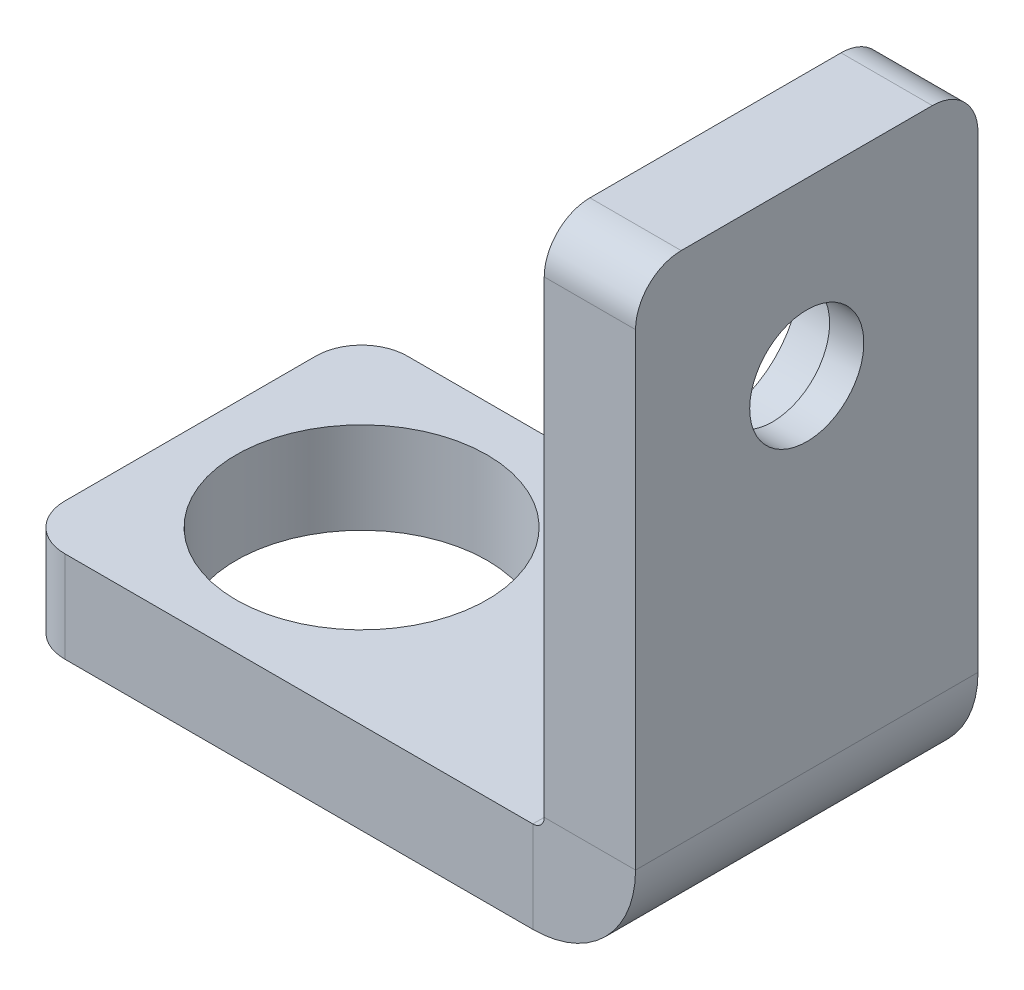
ISO-10303-21;
HEADER;
FILE_DESCRIPTION(('STEP AP214'),'2;1');
FILE_NAME('part.step','',(''),(''),'','','');
FILE_SCHEMA(('AUTOMOTIVE_DESIGN { 1 0 10303 214 1 1 1 1 }'));
ENDSEC;
DATA;
#1=APPLICATION_CONTEXT('core data for automotive mechanical design processes');
#2=APPLICATION_PROTOCOL_DEFINITION('international standard','automotive_design',2000,#1);
#3=PRODUCT_CONTEXT('',#1,'mechanical');
#4=PRODUCT('Part','Part','',(#3));
#5=PRODUCT_RELATED_PRODUCT_CATEGORY('part','',(#4));
#6=PRODUCT_DEFINITION_FORMATION('','',#4);
#7=PRODUCT_DEFINITION_CONTEXT('part definition',#1,'design');
#8=PRODUCT_DEFINITION('design','',#6,#7);
#9=PRODUCT_DEFINITION_SHAPE('','',#8);
#10=(LENGTH_UNIT() NAMED_UNIT(*) SI_UNIT(.MILLI.,.METRE.));
#11=(NAMED_UNIT(*) PLANE_ANGLE_UNIT() SI_UNIT($,.RADIAN.));
#12=(NAMED_UNIT(*) SI_UNIT($,.STERADIAN.) SOLID_ANGLE_UNIT());
#13=UNCERTAINTY_MEASURE_WITH_UNIT(LENGTH_MEASURE(1.E-05),#10,'distance_accuracy_value','');
#14=(GEOMETRIC_REPRESENTATION_CONTEXT(3) GLOBAL_UNCERTAINTY_ASSIGNED_CONTEXT((#13)) GLOBAL_UNIT_ASSIGNED_CONTEXT((#10,
#11,#12)) REPRESENTATION_CONTEXT('',''));
#15=CARTESIAN_POINT('',(0.,0.,0.));
#16=DIRECTION('',(0.,0.,1.));
#17=DIRECTION('',(1.,0.,0.));
#18=AXIS2_PLACEMENT_3D('',#15,#16,#17);
#19=CARTESIAN_POINT('',(-25.,0.,0.));
#20=DIRECTION('',(-1.,0.,0.));
#21=DIRECTION('',(0.,0.,1.));
#22=AXIS2_PLACEMENT_3D('',#19,#20,#21);
#23=PLANE('',#22);
#24=DIRECTION('',(0.,0.,1.));
#25=VECTOR('',#24,1.);
#26=CARTESIAN_POINT('',(-25.,2.,7.5));
#27=LINE('',#26,#25);
#28=CARTESIAN_POINT('',(-25.,2.,-5.5));
#29=VERTEX_POINT('',#28);
#30=CARTESIAN_POINT('',(-25.,2.,5.5));
#31=VERTEX_POINT('',#30);
#32=EDGE_CURVE('E198',#29,#31,#27,.T.);
#33=ORIENTED_EDGE('',*,*,#32,.F.);
#34=DIRECTION('',(0.,1.,0.));
#35=VECTOR('',#34,1.);
#36=CARTESIAN_POINT('',(-25.,0.,-5.5));
#37=LINE('',#36,#35);
#38=CARTESIAN_POINT('',(-25.,-2.,-5.5));
#39=VERTEX_POINT('',#38);
#40=EDGE_CURVE('E64',#29,#39,#37,.F.);
#41=ORIENTED_EDGE('',*,*,#40,.T.);
#42=DIRECTION('',(0.,0.,-1.));
#43=VECTOR('',#42,1.);
#44=CARTESIAN_POINT('',(-25.,-2.,7.5));
#45=LINE('',#44,#43);
#46=CARTESIAN_POINT('',(-25.,-2.,5.5));
#47=VERTEX_POINT('',#46);
#48=EDGE_CURVE('E147',#47,#39,#45,.T.);
#49=ORIENTED_EDGE('',*,*,#48,.F.);
#50=DIRECTION('',(0.,-1.,0.));
#51=VECTOR('',#50,1.);
#52=CARTESIAN_POINT('',(-25.,0.,5.5));
#53=LINE('',#52,#51);
#54=EDGE_CURVE('E282',#47,#31,#53,.F.);
#55=ORIENTED_EDGE('',*,*,#54,.T.);
#56=EDGE_LOOP('',(#33,#41,#49,#55));
#57=FACE_BOUND('',#56,.T.);
#58=ADVANCED_FACE('F40',(#57),#23,.T.);
#59=CARTESIAN_POINT('',(0.,25.,0.));
#60=DIRECTION('',(0.,-1.,0.));
#61=DIRECTION('',(0.,0.,1.));
#62=AXIS2_PLACEMENT_3D('',#59,#60,#61);
#63=PLANE('',#62);
#64=DIRECTION('',(0.,0.,-1.));
#65=VECTOR('',#64,1.);
#66=CARTESIAN_POINT('',(2.,25.,7.5));
#67=LINE('',#66,#65);
#68=CARTESIAN_POINT('',(2.,25.,5.5));
#69=VERTEX_POINT('',#68);
#70=CARTESIAN_POINT('',(2.,25.,-5.5));
#71=VERTEX_POINT('',#70);
#72=EDGE_CURVE('E238',#69,#71,#67,.T.);
#73=ORIENTED_EDGE('',*,*,#72,.T.);
#74=DIRECTION('',(-1.,0.,0.));
#75=VECTOR('',#74,1.);
#76=CARTESIAN_POINT('',(-2.,25.,-5.5));
#77=LINE('',#76,#75);
#78=CARTESIAN_POINT('',(-2.,25.,-5.5));
#79=VERTEX_POINT('',#78);
#80=EDGE_CURVE('E251',#71,#79,#77,.T.);
#81=ORIENTED_EDGE('',*,*,#80,.T.);
#82=DIRECTION('',(0.,0.,1.));
#83=VECTOR('',#82,1.);
#84=CARTESIAN_POINT('',(-2.,25.,7.5));
#85=LINE('',#84,#83);
#86=CARTESIAN_POINT('',(-2.,25.,5.5));
#87=VERTEX_POINT('',#86);
#88=EDGE_CURVE('E192',#79,#87,#85,.T.);
#89=ORIENTED_EDGE('',*,*,#88,.T.);
#90=DIRECTION('',(1.,0.,0.));
#91=VECTOR('',#90,1.);
#92=CARTESIAN_POINT('',(2.,25.,5.5));
#93=LINE('',#92,#91);
#94=EDGE_CURVE('E247',#87,#69,#93,.T.);
#95=ORIENTED_EDGE('',*,*,#94,.T.);
#96=EDGE_LOOP('',(#73,#81,#89,#95));
#97=FACE_BOUND('',#96,.T.);
#98=ADVANCED_FACE('F336',(#97),#63,.F.);
#99=CARTESIAN_POINT('',(-25.,-2.,-7.5));
#100=DIRECTION('',(0.,0.,-1.));
#101=DIRECTION('',(-1.,0.,0.));
#102=AXIS2_PLACEMENT_3D('',#99,#100,#101);
#103=PLANE('',#102);
#104=DIRECTION('',(1.,0.,0.));
#105=VECTOR('',#104,1.);
#106=CARTESIAN_POINT('',(-25.,-2.,-7.5));
#107=LINE('',#106,#105);
#108=CARTESIAN_POINT('',(-23.,-2.,-7.5));
#109=VERTEX_POINT('',#108);
#110=CARTESIAN_POINT('',(-2.50000000000002,-2.,-7.5));
#111=VERTEX_POINT('',#110);
#112=EDGE_CURVE('E133',#109,#111,#107,.T.);
#113=ORIENTED_EDGE('',*,*,#112,.F.);
#114=DIRECTION('',(0.,1.,0.));
#115=VECTOR('',#114,1.);
#116=CARTESIAN_POINT('',(-23.,-2.,-7.5));
#117=LINE('',#116,#115);
#118=CARTESIAN_POINT('',(-23.,2.,-7.5));
#119=VERTEX_POINT('',#118);
#120=EDGE_CURVE('E273',#109,#119,#117,.T.);
#121=ORIENTED_EDGE('',*,*,#120,.T.);
#122=DIRECTION('',(1.,0.,0.));
#123=VECTOR('',#122,1.);
#124=CARTESIAN_POINT('',(-25.,2.,-7.5));
#125=LINE('',#124,#123);
#126=CARTESIAN_POINT('',(-2.50000000000002,2.,-7.5));
#127=VERTEX_POINT('',#126);
#128=EDGE_CURVE('E171',#119,#127,#125,.T.);
#129=ORIENTED_EDGE('',*,*,#128,.T.);
#130=DIRECTION('',(0.,1.,0.));
#131=VECTOR('',#130,1.);
#132=CARTESIAN_POINT('',(-2.50000000000002,-2.,-7.5));
#133=LINE('',#132,#131);
#134=EDGE_CURVE('E146',#111,#127,#133,.T.);
#135=ORIENTED_EDGE('',*,*,#134,.F.);
#136=EDGE_LOOP('',(#113,#121,#129,#135));
#137=FACE_BOUND('',#136,.T.);
#138=ADVANCED_FACE('F169',(#137),#103,.T.);
#139=CARTESIAN_POINT('',(-25.,2.,7.5));
#140=DIRECTION('',(0.,1.,0.));
#141=DIRECTION('',(0.,0.,1.));
#142=AXIS2_PLACEMENT_3D('',#139,#140,#141);
#143=PLANE('',#142);
#144=CARTESIAN_POINT('',(-17.5,2.,0.));
#145=DIRECTION('',(0.,1.,0.));
#146=DIRECTION('',(0.,0.,1.));
#147=AXIS2_PLACEMENT_3D('',#144,#145,#146);
#148=CIRCLE('',#147,5.5);
#149=CARTESIAN_POINT('',(-17.5,2.,5.5));
#150=VERTEX_POINT('',#149);
#151=EDGE_CURVE('E179',#150,#150,#148,.T.);
#152=ORIENTED_EDGE('',*,*,#151,.F.);
#153=EDGE_LOOP('',(#152));
#154=FACE_BOUND('',#153,.T.);
#155=ORIENTED_EDGE('',*,*,#128,.F.);
#156=CARTESIAN_POINT('',(-23.,2.,-5.5));
#157=DIRECTION('',(0.,1.,0.));
#158=DIRECTION('',(0.,0.,1.));
#159=AXIS2_PLACEMENT_3D('',#156,#157,#158);
#160=CIRCLE('',#159,2.);
#161=EDGE_CURVE('E279',#119,#29,#160,.T.);
#162=ORIENTED_EDGE('',*,*,#161,.T.);
#163=ORIENTED_EDGE('',*,*,#32,.T.);
#164=CARTESIAN_POINT('',(-23.,2.,5.5));
#165=DIRECTION('',(0.,1.,0.));
#166=DIRECTION('',(0.,0.,1.));
#167=AXIS2_PLACEMENT_3D('',#164,#165,#166);
#168=CIRCLE('',#167,2.);
#169=CARTESIAN_POINT('',(-23.,2.,7.5));
#170=VERTEX_POINT('',#169);
#171=EDGE_CURVE('E276',#31,#170,#168,.T.);
#172=ORIENTED_EDGE('',*,*,#171,.T.);
#173=DIRECTION('',(1.,0.,0.));
#174=VECTOR('',#173,1.);
#175=CARTESIAN_POINT('',(-25.,2.,7.5));
#176=LINE('',#175,#174);
#177=CARTESIAN_POINT('',(-2.50000000000002,2.,7.5));
#178=VERTEX_POINT('',#177);
#179=EDGE_CURVE('E206',#170,#178,#176,.T.);
#180=ORIENTED_EDGE('',*,*,#179,.T.);
#181=DIRECTION('',(0.,0.,1.));
#182=VECTOR('',#181,1.);
#183=CARTESIAN_POINT('',(-2.50000000000002,2.,7.5));
#184=LINE('',#183,#182);
#185=EDGE_CURVE('E176',#127,#178,#184,.T.);
#186=ORIENTED_EDGE('',*,*,#185,.F.);
#187=EDGE_LOOP('',(#155,#162,#163,#172,#180,#186));
#188=FACE_BOUND('',#187,.T.);
#189=ADVANCED_FACE('F293',(#154,#188),#143,.T.);
#190=CARTESIAN_POINT('',(-25.,-2.,7.5));
#191=DIRECTION('',(0.,0.,1.));
#192=DIRECTION('',(1.,0.,0.));
#193=AXIS2_PLACEMENT_3D('',#190,#191,#192);
#194=PLANE('',#193);
#195=ORIENTED_EDGE('',*,*,#179,.F.);
#196=DIRECTION('',(0.,-1.,0.));
#197=VECTOR('',#196,1.);
#198=CARTESIAN_POINT('',(-23.,-2.,7.5));
#199=LINE('',#198,#197);
#200=CARTESIAN_POINT('',(-23.,-2.,7.5));
#201=VERTEX_POINT('',#200);
#202=EDGE_CURVE('E12',#170,#201,#199,.T.);
#203=ORIENTED_EDGE('',*,*,#202,.T.);
#204=DIRECTION('',(1.,0.,0.));
#205=VECTOR('',#204,1.);
#206=CARTESIAN_POINT('',(-25.,-2.,7.5));
#207=LINE('',#206,#205);
#208=CARTESIAN_POINT('',(-2.50000000000002,-2.,7.5));
#209=VERTEX_POINT('',#208);
#210=EDGE_CURVE('E167',#201,#209,#207,.T.);
#211=ORIENTED_EDGE('',*,*,#210,.T.);
#212=DIRECTION('',(0.,-1.,0.));
#213=VECTOR('',#212,1.);
#214=CARTESIAN_POINT('',(-2.50000000000002,-2.,7.5));
#215=LINE('',#214,#213);
#216=EDGE_CURVE('E209',#178,#209,#215,.T.);
#217=ORIENTED_EDGE('',*,*,#216,.F.);
#218=EDGE_LOOP('',(#195,#203,#211,#217));
#219=FACE_BOUND('',#218,.T.);
#220=ADVANCED_FACE('F298',(#219),#194,.T.);
#221=CARTESIAN_POINT('',(-25.,-2.,7.5));
#222=DIRECTION('',(0.,-1.,0.));
#223=DIRECTION('',(0.,0.,-1.));
#224=AXIS2_PLACEMENT_3D('',#221,#222,#223);
#225=PLANE('',#224);
#226=CARTESIAN_POINT('',(-17.5,-2.00000000000018,0.));
#227=DIRECTION('',(0.,1.,0.));
#228=DIRECTION('',(0.,0.,1.));
#229=AXIS2_PLACEMENT_3D('',#226,#227,#228);
#230=CIRCLE('',#229,5.5);
#231=CARTESIAN_POINT('',(-17.5,-2.00000000000018,5.5));
#232=VERTEX_POINT('',#231);
#233=EDGE_CURVE('E202',#232,#232,#230,.T.);
#234=ORIENTED_EDGE('',*,*,#233,.T.);
#235=EDGE_LOOP('',(#234));
#236=FACE_BOUND('',#235,.T.);
#237=ORIENTED_EDGE('',*,*,#48,.T.);
#238=CARTESIAN_POINT('',(-23.,-2.,-5.5));
#239=DIRECTION('',(0.,-1.,0.));
#240=DIRECTION('',(0.,0.,-1.));
#241=AXIS2_PLACEMENT_3D('',#238,#239,#240);
#242=CIRCLE('',#241,2.);
#243=EDGE_CURVE('E50',#39,#109,#242,.T.);
#244=ORIENTED_EDGE('',*,*,#243,.T.);
#245=ORIENTED_EDGE('',*,*,#112,.T.);
#246=DIRECTION('',(0.,0.,-1.));
#247=VECTOR('',#246,1.);
#248=CARTESIAN_POINT('',(-2.50000000000002,-2.,7.5));
#249=LINE('',#248,#247);
#250=EDGE_CURVE('E138',#209,#111,#249,.T.);
#251=ORIENTED_EDGE('',*,*,#250,.F.);
#252=ORIENTED_EDGE('',*,*,#210,.F.);
#253=CARTESIAN_POINT('',(-23.,-2.,5.5));
#254=DIRECTION('',(0.,-1.,0.));
#255=DIRECTION('',(0.,0.,-1.));
#256=AXIS2_PLACEMENT_3D('',#253,#254,#255);
#257=CIRCLE('',#256,2.);
#258=EDGE_CURVE('E57',#201,#47,#257,.T.);
#259=ORIENTED_EDGE('',*,*,#258,.T.);
#260=EDGE_LOOP('',(#237,#244,#245,#251,#252,#259));
#261=FACE_BOUND('',#260,.T.);
#262=ADVANCED_FACE('F135',(#236,#261),#225,.T.);
#263=CARTESIAN_POINT('',(-2.50000000000002,-2.00000000000018,-7.5));
#264=DIRECTION('',(0.,0.,-1.));
#265=DIRECTION('',(-1.,0.,0.));
#266=AXIS2_PLACEMENT_3D('',#263,#264,#265);
#267=PLANE('',#266);
#268=CARTESIAN_POINT('',(-2.5,2.5,-7.5));
#269=DIRECTION('',(0.,0.,1.));
#270=DIRECTION('',(0.,-1.,0.));
#271=AXIS2_PLACEMENT_3D('',#268,#269,#270);
#272=CIRCLE('',#271,0.500000000000182);
#273=CARTESIAN_POINT('',(-1.99999999999982,2.5,-7.5));
#274=VERTEX_POINT('',#273);
#275=EDGE_CURVE('E184',#127,#274,#272,.T.);
#276=ORIENTED_EDGE('',*,*,#275,.T.);
#277=DIRECTION('',(-1.,0.,0.));
#278=VECTOR('',#277,1.);
#279=CARTESIAN_POINT('',(2.,2.5,-7.5));
#280=LINE('',#279,#278);
#281=CARTESIAN_POINT('',(2.00000000000018,2.5,-7.5));
#282=VERTEX_POINT('',#281);
#283=EDGE_CURVE('E157',#282,#274,#280,.T.);
#284=ORIENTED_EDGE('',*,*,#283,.F.);
#285=CARTESIAN_POINT('',(-2.5,2.5,-7.5));
#286=DIRECTION('',(0.,0.,1.));
#287=DIRECTION('',(0.,-1.,0.));
#288=AXIS2_PLACEMENT_3D('',#285,#286,#287);
#289=CIRCLE('',#288,4.50000000000018);
#290=EDGE_CURVE('E153',#111,#282,#289,.T.);
#291=ORIENTED_EDGE('',*,*,#290,.F.);
#292=ORIENTED_EDGE('',*,*,#134,.T.);
#293=EDGE_LOOP('',(#276,#284,#291,#292));
#294=FACE_BOUND('',#293,.T.);
#295=ADVANCED_FACE('F155',(#294),#267,.T.);
#296=CARTESIAN_POINT('',(-2.5,2.5,0.));
#297=DIRECTION('',(0.,0.,1.));
#298=DIRECTION('',(1.,0.,0.));
#299=AXIS2_PLACEMENT_3D('',#296,#297,#298);
#300=CYLINDRICAL_SURFACE('',#299,0.500000000000182);
#301=CARTESIAN_POINT('',(-2.5,2.5,7.5));
#302=DIRECTION('',(0.,0.,1.));
#303=DIRECTION('',(0.,-1.,0.));
#304=AXIS2_PLACEMENT_3D('',#301,#302,#303);
#305=CIRCLE('',#304,0.500000000000182);
#306=CARTESIAN_POINT('',(-1.99999999999982,2.5,7.5));
#307=VERTEX_POINT('',#306);
#308=EDGE_CURVE('E213',#178,#307,#305,.T.);
#309=ORIENTED_EDGE('',*,*,#308,.T.);
#310=DIRECTION('',(0.,0.,1.));
#311=VECTOR('',#310,1.);
#312=CARTESIAN_POINT('',(-2.,2.5,7.5));
#313=LINE('',#312,#311);
#314=EDGE_CURVE('E186',#274,#307,#313,.T.);
#315=ORIENTED_EDGE('',*,*,#314,.F.);
#316=ORIENTED_EDGE('',*,*,#275,.F.);
#317=ORIENTED_EDGE('',*,*,#185,.T.);
#318=EDGE_LOOP('',(#309,#315,#316,#317));
#319=FACE_BOUND('',#318,.T.);
#320=ADVANCED_FACE('F301',(#319),#300,.F.);
#321=CARTESIAN_POINT('',(-2.50000000000002,-2.00000000000018,7.5));
#322=DIRECTION('',(0.,0.,1.));
#323=DIRECTION('',(1.,0.,0.));
#324=AXIS2_PLACEMENT_3D('',#321,#322,#323);
#325=PLANE('',#324);
#326=CARTESIAN_POINT('',(-2.5,2.5,7.5));
#327=DIRECTION('',(0.,0.,1.));
#328=DIRECTION('',(0.,-1.,0.));
#329=AXIS2_PLACEMENT_3D('',#326,#327,#328);
#330=CIRCLE('',#329,4.50000000000018);
#331=CARTESIAN_POINT('',(2.00000000000018,2.5,7.5));
#332=VERTEX_POINT('',#331);
#333=EDGE_CURVE('E165',#209,#332,#330,.T.);
#334=ORIENTED_EDGE('',*,*,#333,.T.);
#335=DIRECTION('',(1.,0.,0.));
#336=VECTOR('',#335,1.);
#337=CARTESIAN_POINT('',(2.,2.5,7.5));
#338=LINE('',#337,#336);
#339=EDGE_CURVE('E217',#307,#332,#338,.T.);
#340=ORIENTED_EDGE('',*,*,#339,.F.);
#341=ORIENTED_EDGE('',*,*,#308,.F.);
#342=ORIENTED_EDGE('',*,*,#216,.T.);
#343=EDGE_LOOP('',(#334,#340,#341,#342));
#344=FACE_BOUND('',#343,.T.);
#345=ADVANCED_FACE('F359',(#344),#325,.T.);
#346=CARTESIAN_POINT('',(-2.5,2.5,0.));
#347=DIRECTION('',(0.,0.,1.));
#348=DIRECTION('',(1.,0.,0.));
#349=AXIS2_PLACEMENT_3D('',#346,#347,#348);
#350=CYLINDRICAL_SURFACE('',#349,4.50000000000018);
#351=DIRECTION('',(0.,0.,-1.));
#352=VECTOR('',#351,1.);
#353=CARTESIAN_POINT('',(2.,2.5,7.5));
#354=LINE('',#353,#352);
#355=EDGE_CURVE('E197',#332,#282,#354,.T.);
#356=ORIENTED_EDGE('',*,*,#355,.F.);
#357=ORIENTED_EDGE('',*,*,#333,.F.);
#358=ORIENTED_EDGE('',*,*,#250,.T.);
#359=ORIENTED_EDGE('',*,*,#290,.T.);
#360=EDGE_LOOP('',(#356,#357,#358,#359));
#361=FACE_BOUND('',#360,.T.);
#362=ADVANCED_FACE('F163',(#361),#350,.T.);
#363=CARTESIAN_POINT('',(2.,2.5,-7.5));
#364=DIRECTION('',(0.,0.,-1.));
#365=DIRECTION('',(-1.,0.,0.));
#366=AXIS2_PLACEMENT_3D('',#363,#364,#365);
#367=PLANE('',#366);
#368=DIRECTION('',(0.,1.,0.));
#369=VECTOR('',#368,1.);
#370=CARTESIAN_POINT('',(-2.,2.5,-7.5));
#371=LINE('',#370,#369);
#372=CARTESIAN_POINT('',(-2.,23.,-7.5));
#373=VERTEX_POINT('',#372);
#374=EDGE_CURVE('E188',#274,#373,#371,.T.);
#375=ORIENTED_EDGE('',*,*,#374,.T.);
#376=DIRECTION('',(-1.,0.,0.));
#377=VECTOR('',#376,1.);
#378=CARTESIAN_POINT('',(2.,23.,-7.5));
#379=LINE('',#378,#377);
#380=CARTESIAN_POINT('',(2.,23.,-7.5));
#381=VERTEX_POINT('',#380);
#382=EDGE_CURVE('E261',#373,#381,#379,.F.);
#383=ORIENTED_EDGE('',*,*,#382,.T.);
#384=DIRECTION('',(0.,1.,0.));
#385=VECTOR('',#384,1.);
#386=CARTESIAN_POINT('',(2.,2.5,-7.5));
#387=LINE('',#386,#385);
#388=EDGE_CURVE('E193',#282,#381,#387,.T.);
#389=ORIENTED_EDGE('',*,*,#388,.F.);
#390=ORIENTED_EDGE('',*,*,#283,.T.);
#391=EDGE_LOOP('',(#375,#383,#389,#390));
#392=FACE_BOUND('',#391,.T.);
#393=ADVANCED_FACE('F366',(#392),#367,.T.);
#394=CARTESIAN_POINT('',(-2.,2.5,7.5));
#395=DIRECTION('',(-1.,0.,0.));
#396=DIRECTION('',(0.,0.,1.));
#397=AXIS2_PLACEMENT_3D('',#394,#395,#396);
#398=PLANE('',#397);
#399=CARTESIAN_POINT('',(-2.,17.5,0.));
#400=DIRECTION('',(-1.,0.,0.));
#401=DIRECTION('',(0.,0.,1.));
#402=AXIS2_PLACEMENT_3D('',#399,#400,#401);
#403=CIRCLE('',#402,3.7);
#404=CARTESIAN_POINT('',(-2.,17.5,3.7));
#405=VERTEX_POINT('',#404);
#406=EDGE_CURVE('E390',#405,#405,#403,.T.);
#407=ORIENTED_EDGE('',*,*,#406,.F.);
#408=EDGE_LOOP('',(#407));
#409=FACE_BOUND('',#408,.T.);
#410=ORIENTED_EDGE('',*,*,#88,.F.);
#411=CARTESIAN_POINT('',(-2.,23.,-5.5));
#412=DIRECTION('',(-1.,0.,0.));
#413=DIRECTION('',(0.,0.,1.));
#414=AXIS2_PLACEMENT_3D('',#411,#412,#413);
#415=CIRCLE('',#414,2.);
#416=EDGE_CURVE('E258',#79,#373,#415,.T.);
#417=ORIENTED_EDGE('',*,*,#416,.T.);
#418=ORIENTED_EDGE('',*,*,#374,.F.);
#419=ORIENTED_EDGE('',*,*,#314,.T.);
#420=DIRECTION('',(0.,1.,0.));
#421=VECTOR('',#420,1.);
#422=CARTESIAN_POINT('',(-2.,2.5,7.5));
#423=LINE('',#422,#421);
#424=CARTESIAN_POINT('',(-2.,23.,7.5));
#425=VERTEX_POINT('',#424);
#426=EDGE_CURVE('E221',#307,#425,#423,.T.);
#427=ORIENTED_EDGE('',*,*,#426,.T.);
#428=CARTESIAN_POINT('',(-2.,23.,5.5));
#429=DIRECTION('',(-1.,0.,0.));
#430=DIRECTION('',(0.,0.,1.));
#431=AXIS2_PLACEMENT_3D('',#428,#429,#430);
#432=CIRCLE('',#431,2.);
#433=EDGE_CURVE('E255',#425,#87,#432,.T.);
#434=ORIENTED_EDGE('',*,*,#433,.T.);
#435=EDGE_LOOP('',(#410,#417,#418,#419,#427,#434));
#436=FACE_BOUND('',#435,.T.);
#437=ADVANCED_FACE('F328',(#409,#436),#398,.T.);
#438=CARTESIAN_POINT('',(2.,2.5,7.5));
#439=DIRECTION('',(0.,0.,1.));
#440=DIRECTION('',(1.,0.,0.));
#441=AXIS2_PLACEMENT_3D('',#438,#439,#440);
#442=PLANE('',#441);
#443=DIRECTION('',(0.,1.,0.));
#444=VECTOR('',#443,1.);
#445=CARTESIAN_POINT('',(2.,2.5,7.5));
#446=LINE('',#445,#444);
#447=CARTESIAN_POINT('',(2.,23.,7.5));
#448=VERTEX_POINT('',#447);
#449=EDGE_CURVE('E225',#332,#448,#446,.T.);
#450=ORIENTED_EDGE('',*,*,#449,.T.);
#451=DIRECTION('',(1.,0.,0.));
#452=VECTOR('',#451,1.);
#453=CARTESIAN_POINT('',(-2.,23.,7.5));
#454=LINE('',#453,#452);
#455=EDGE_CURVE('E270',#448,#425,#454,.F.);
#456=ORIENTED_EDGE('',*,*,#455,.T.);
#457=ORIENTED_EDGE('',*,*,#426,.F.);
#458=ORIENTED_EDGE('',*,*,#339,.T.);
#459=EDGE_LOOP('',(#450,#456,#457,#458));
#460=FACE_BOUND('',#459,.T.);
#461=ADVANCED_FACE('F318',(#460),#442,.T.);
#462=CARTESIAN_POINT('',(2.,2.5,7.5));
#463=DIRECTION('',(1.,0.,0.));
#464=DIRECTION('',(0.,0.,-1.));
#465=AXIS2_PLACEMENT_3D('',#462,#463,#464);
#466=PLANE('',#465);
#467=CARTESIAN_POINT('',(2.00000000000018,17.5,0.));
#468=DIRECTION('',(-1.,0.,0.));
#469=DIRECTION('',(0.,0.,1.));
#470=AXIS2_PLACEMENT_3D('',#467,#468,#469);
#471=CIRCLE('',#470,2.5);
#472=CARTESIAN_POINT('',(2.00000000000018,17.5,2.5));
#473=VERTEX_POINT('',#472);
#474=EDGE_CURVE('E382',#473,#473,#471,.T.);
#475=ORIENTED_EDGE('',*,*,#474,.T.);
#476=EDGE_LOOP('',(#475));
#477=FACE_BOUND('',#476,.T.);
#478=ORIENTED_EDGE('',*,*,#388,.T.);
#479=CARTESIAN_POINT('',(2.,23.,-5.5));
#480=DIRECTION('',(1.,0.,0.));
#481=DIRECTION('',(0.,0.,-1.));
#482=AXIS2_PLACEMENT_3D('',#479,#480,#481);
#483=CIRCLE('',#482,2.);
#484=EDGE_CURVE('E267',#381,#71,#483,.T.);
#485=ORIENTED_EDGE('',*,*,#484,.T.);
#486=ORIENTED_EDGE('',*,*,#72,.F.);
#487=CARTESIAN_POINT('',(2.,23.,5.5));
#488=DIRECTION('',(1.,0.,0.));
#489=DIRECTION('',(0.,0.,-1.));
#490=AXIS2_PLACEMENT_3D('',#487,#488,#489);
#491=CIRCLE('',#490,2.);
#492=EDGE_CURVE('E264',#69,#448,#491,.T.);
#493=ORIENTED_EDGE('',*,*,#492,.T.);
#494=ORIENTED_EDGE('',*,*,#449,.F.);
#495=ORIENTED_EDGE('',*,*,#355,.T.);
#496=EDGE_LOOP('',(#478,#485,#486,#493,#494,#495));
#497=FACE_BOUND('',#496,.T.);
#498=ADVANCED_FACE('F315',(#477,#497),#466,.T.);
#499=CARTESIAN_POINT('',(-17.5,-2.00000000000018,0.));
#500=DIRECTION('',(0.,1.,0.));
#501=DIRECTION('',(0.,0.,1.));
#502=AXIS2_PLACEMENT_3D('',#499,#500,#501);
#503=CYLINDRICAL_SURFACE('',#502,5.5);
#504=ORIENTED_EDGE('',*,*,#233,.F.);
#505=EDGE_LOOP('',(#504));
#506=FACE_BOUND('',#505,.T.);
#507=ORIENTED_EDGE('',*,*,#151,.T.);
#508=EDGE_LOOP('',(#507));
#509=FACE_BOUND('',#508,.T.);
#510=ADVANCED_FACE('F317',(#506,#509),#503,.F.);
#511=CARTESIAN_POINT('',(2.00000000000018,17.5,0.));
#512=DIRECTION('',(-1.,0.,0.));
#513=DIRECTION('',(0.,0.,1.));
#514=AXIS2_PLACEMENT_3D('',#511,#512,#513);
#515=CYLINDRICAL_SURFACE('',#514,2.5);
#516=CARTESIAN_POINT('',(0.5,17.5,0.));
#517=DIRECTION('',(1.,0.,0.));
#518=DIRECTION('',(0.,0.,-1.));
#519=AXIS2_PLACEMENT_3D('',#516,#517,#518);
#520=CIRCLE('',#519,2.5);
#521=CARTESIAN_POINT('',(0.5,17.5,-2.5));
#522=VERTEX_POINT('',#521);
#523=EDGE_CURVE('E44',#522,#522,#520,.F.);
#524=ORIENTED_EDGE('',*,*,#523,.T.);
#525=EDGE_LOOP('',(#524));
#526=FACE_BOUND('',#525,.T.);
#527=ORIENTED_EDGE('',*,*,#474,.F.);
#528=EDGE_LOOP('',(#527));
#529=FACE_BOUND('',#528,.T.);
#530=ADVANCED_FACE('F325',(#526,#529),#515,.F.);
#531=CARTESIAN_POINT('',(0.,23.,-5.5));
#532=DIRECTION('',(1.,0.,0.));
#533=DIRECTION('',(0.,0.,-1.));
#534=AXIS2_PLACEMENT_3D('',#531,#532,#533);
#535=CYLINDRICAL_SURFACE('',#534,2.);
#536=ORIENTED_EDGE('',*,*,#484,.F.);
#537=ORIENTED_EDGE('',*,*,#382,.F.);
#538=ORIENTED_EDGE('',*,*,#416,.F.);
#539=ORIENTED_EDGE('',*,*,#80,.F.);
#540=EDGE_LOOP('',(#536,#537,#538,#539));
#541=FACE_BOUND('',#540,.T.);
#542=ADVANCED_FACE('F312',(#541),#535,.T.);
#543=CARTESIAN_POINT('',(0.,23.,5.5));
#544=DIRECTION('',(-1.,0.,0.));
#545=DIRECTION('',(0.,0.,1.));
#546=AXIS2_PLACEMENT_3D('',#543,#544,#545);
#547=CYLINDRICAL_SURFACE('',#546,2.);
#548=ORIENTED_EDGE('',*,*,#433,.F.);
#549=ORIENTED_EDGE('',*,*,#455,.F.);
#550=ORIENTED_EDGE('',*,*,#492,.F.);
#551=ORIENTED_EDGE('',*,*,#94,.F.);
#552=EDGE_LOOP('',(#548,#549,#550,#551));
#553=FACE_BOUND('',#552,.T.);
#554=ADVANCED_FACE('F306',(#553),#547,.T.);
#555=CARTESIAN_POINT('',(-23.,-2.,-5.5));
#556=DIRECTION('',(0.,1.,0.));
#557=DIRECTION('',(0.,0.,1.));
#558=AXIS2_PLACEMENT_3D('',#555,#556,#557);
#559=CYLINDRICAL_SURFACE('',#558,2.);
#560=ORIENTED_EDGE('',*,*,#243,.F.);
#561=ORIENTED_EDGE('',*,*,#40,.F.);
#562=ORIENTED_EDGE('',*,*,#161,.F.);
#563=ORIENTED_EDGE('',*,*,#120,.F.);
#564=EDGE_LOOP('',(#560,#561,#562,#563));
#565=FACE_BOUND('',#564,.T.);
#566=ADVANCED_FACE('F304',(#565),#559,.T.);
#567=CARTESIAN_POINT('',(-23.,-2.,5.5));
#568=DIRECTION('',(0.,-1.,0.));
#569=DIRECTION('',(0.,0.,-1.));
#570=AXIS2_PLACEMENT_3D('',#567,#568,#569);
#571=CYLINDRICAL_SURFACE('',#570,2.);
#572=ORIENTED_EDGE('',*,*,#171,.F.);
#573=ORIENTED_EDGE('',*,*,#54,.F.);
#574=ORIENTED_EDGE('',*,*,#258,.F.);
#575=ORIENTED_EDGE('',*,*,#202,.F.);
#576=EDGE_LOOP('',(#572,#573,#574,#575));
#577=FACE_BOUND('',#576,.T.);
#578=ADVANCED_FACE('F42',(#577),#571,.T.);
#579=CARTESIAN_POINT('',(0.5,2.5,7.5));
#580=DIRECTION('',(1.,0.,0.));
#581=DIRECTION('',(0.,0.,-1.));
#582=AXIS2_PLACEMENT_3D('',#579,#580,#581);
#583=PLANE('',#582);
#584=CARTESIAN_POINT('',(0.5,17.5,0.));
#585=DIRECTION('',(1.,0.,0.));
#586=DIRECTION('',(0.,0.,-1.));
#587=AXIS2_PLACEMENT_3D('',#584,#585,#586);
#588=CIRCLE('',#587,3.7);
#589=CARTESIAN_POINT('',(0.5,17.5,-3.7));
#590=VERTEX_POINT('',#589);
#591=EDGE_CURVE('E386',#590,#590,#588,.F.);
#592=ORIENTED_EDGE('',*,*,#591,.T.);
#593=EDGE_LOOP('',(#592));
#594=FACE_BOUND('',#593,.T.);
#595=ORIENTED_EDGE('',*,*,#523,.F.);
#596=EDGE_LOOP('',(#595));
#597=FACE_BOUND('',#596,.T.);
#598=ADVANCED_FACE('F311',(#594,#597),#583,.F.);
#599=CARTESIAN_POINT('',(12.4651803615609,17.5,0.));
#600=DIRECTION('',(-1.,0.,0.));
#601=DIRECTION('',(0.,0.,1.));
#602=AXIS2_PLACEMENT_3D('',#599,#600,#601);
#603=CYLINDRICAL_SURFACE('',#602,3.7);
#604=ORIENTED_EDGE('',*,*,#406,.T.);
#605=EDGE_LOOP('',(#604));
#606=FACE_BOUND('',#605,.T.);
#607=ORIENTED_EDGE('',*,*,#591,.F.);
#608=EDGE_LOOP('',(#607));
#609=FACE_BOUND('',#608,.T.);
#610=ADVANCED_FACE('F395',(#606,#609),#603,.F.);
#611=CLOSED_SHELL('',(#58,#98,#138,#189,#220,#262,#295,#320,#345,#362,#393,#437,#461,#498,#510,
#530,#542,#554,#566,#578,#598,#610));
#612=MANIFOLD_SOLID_BREP('B2',#611);
#613=ADVANCED_BREP_SHAPE_REPRESENTATION('',(#18,#612),#14);
#614=SHAPE_DEFINITION_REPRESENTATION(#9,#613);
ENDSEC;
END-ISO-10303-21;
